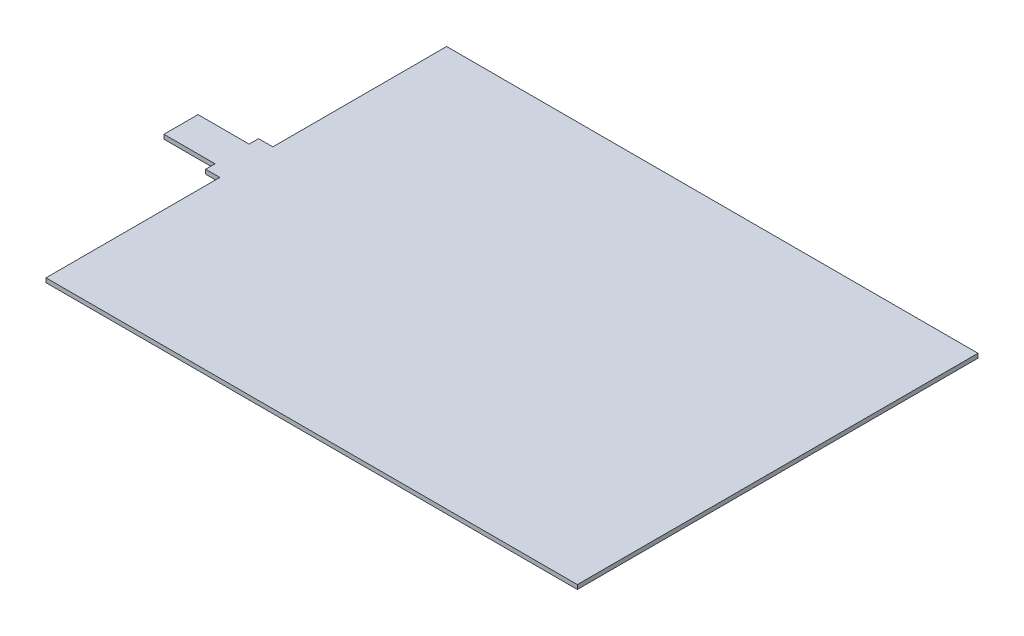
ISO-10303-21;
HEADER;
FILE_DESCRIPTION(('STEP AP214'),'2;1');
FILE_NAME('part.step','',(''),(''),'','','');
FILE_SCHEMA(('AUTOMOTIVE_DESIGN { 1 0 10303 214 1 1 1 1 }'));
ENDSEC;
DATA;
#1=APPLICATION_CONTEXT('core data for automotive mechanical design processes');
#2=APPLICATION_PROTOCOL_DEFINITION('international standard','automotive_design',2000,#1);
#3=PRODUCT_CONTEXT('',#1,'mechanical');
#4=PRODUCT('Part','Part','',(#3));
#5=PRODUCT_RELATED_PRODUCT_CATEGORY('part','',(#4));
#6=PRODUCT_DEFINITION_FORMATION('','',#4);
#7=PRODUCT_DEFINITION_CONTEXT('part definition',#1,'design');
#8=PRODUCT_DEFINITION('design','',#6,#7);
#9=PRODUCT_DEFINITION_SHAPE('','',#8);
#10=(LENGTH_UNIT() NAMED_UNIT(*) SI_UNIT(.MILLI.,.METRE.));
#11=(NAMED_UNIT(*) PLANE_ANGLE_UNIT() SI_UNIT($,.RADIAN.));
#12=(NAMED_UNIT(*) SI_UNIT($,.STERADIAN.) SOLID_ANGLE_UNIT());
#13=UNCERTAINTY_MEASURE_WITH_UNIT(LENGTH_MEASURE(1.E-05),#10,'distance_accuracy_value','');
#14=(GEOMETRIC_REPRESENTATION_CONTEXT(3) GLOBAL_UNCERTAINTY_ASSIGNED_CONTEXT((#13)) GLOBAL_UNIT_ASSIGNED_CONTEXT((#10,
#11,#12)) REPRESENTATION_CONTEXT('',''));
#15=CARTESIAN_POINT('',(0.,0.,0.));
#16=DIRECTION('',(0.,0.,1.));
#17=DIRECTION('',(1.,0.,0.));
#18=AXIS2_PLACEMENT_3D('',#15,#16,#17);
#19=CARTESIAN_POINT('',(-98.5,1.5,9.325));
#20=DIRECTION('',(1.,0.,0.));
#21=DIRECTION('',(0.,0.,-1.));
#22=AXIS2_PLACEMENT_3D('',#19,#20,#21);
#23=PLANE('',#22);
#24=DIRECTION('',(0.,1.,0.));
#25=VECTOR('',#24,1.);
#26=CARTESIAN_POINT('',(-98.5,-21.6333076527839,6.00000000000001));
#27=LINE('',#26,#25);
#28=CARTESIAN_POINT('',(-98.5,0.,6.00000000000001));
#29=VERTEX_POINT('',#28);
#30=CARTESIAN_POINT('',(-98.5,1.5,6.00000000000001));
#31=VERTEX_POINT('',#30);
#32=EDGE_CURVE('E235',#29,#31,#27,.T.);
#33=ORIENTED_EDGE('',*,*,#32,.F.);
#34=DIRECTION('',(0.,0.,1.));
#35=VECTOR('',#34,1.);
#36=CARTESIAN_POINT('',(-98.5,0.,9.325));
#37=LINE('',#36,#35);
#38=CARTESIAN_POINT('',(-98.5,0.,9.325));
#39=VERTEX_POINT('',#38);
#40=EDGE_CURVE('E173',#29,#39,#37,.T.);
#41=ORIENTED_EDGE('',*,*,#40,.T.);
#42=DIRECTION('',(0.,-1.,0.));
#43=VECTOR('',#42,1.);
#44=CARTESIAN_POINT('',(-98.5,1.5,9.325));
#45=LINE('',#44,#43);
#46=CARTESIAN_POINT('',(-98.5,1.5,9.325));
#47=VERTEX_POINT('',#46);
#48=EDGE_CURVE('E148',#47,#39,#45,.T.);
#49=ORIENTED_EDGE('',*,*,#48,.F.);
#50=DIRECTION('',(0.,0.,1.));
#51=VECTOR('',#50,1.);
#52=CARTESIAN_POINT('',(-98.5,1.5,9.325));
#53=LINE('',#52,#51);
#54=EDGE_CURVE('E133',#31,#47,#53,.T.);
#55=ORIENTED_EDGE('',*,*,#54,.F.);
#56=EDGE_LOOP('',(#33,#41,#49,#55));
#57=FACE_BOUND('',#56,.T.);
#58=ADVANCED_FACE('F43',(#57),#23,.F.);
#59=CARTESIAN_POINT('',(93.5,1.5,70.5));
#60=DIRECTION('',(-1.,0.,0.));
#61=DIRECTION('',(0.,0.,1.));
#62=AXIS2_PLACEMENT_3D('',#59,#60,#61);
#63=PLANE('',#62);
#64=DIRECTION('',(0.,0.,-1.));
#65=VECTOR('',#64,1.);
#66=CARTESIAN_POINT('',(93.5,0.,70.5));
#67=LINE('',#66,#65);
#68=CARTESIAN_POINT('',(93.5,0.,70.5));
#69=VERTEX_POINT('',#68);
#70=CARTESIAN_POINT('',(93.5,0.,-70.5));
#71=VERTEX_POINT('',#70);
#72=EDGE_CURVE('E159',#69,#71,#67,.T.);
#73=ORIENTED_EDGE('',*,*,#72,.T.);
#74=DIRECTION('',(0.,-1.,0.));
#75=VECTOR('',#74,1.);
#76=CARTESIAN_POINT('',(93.5,1.5,-70.5));
#77=LINE('',#76,#75);
#78=CARTESIAN_POINT('',(93.5,1.5,-70.5));
#79=VERTEX_POINT('',#78);
#80=EDGE_CURVE('E11',#79,#71,#77,.T.);
#81=ORIENTED_EDGE('',*,*,#80,.F.);
#82=DIRECTION('',(0.,0.,-1.));
#83=VECTOR('',#82,1.);
#84=CARTESIAN_POINT('',(93.5,1.5,70.5));
#85=LINE('',#84,#83);
#86=CARTESIAN_POINT('',(93.5,1.5,70.5));
#87=VERTEX_POINT('',#86);
#88=EDGE_CURVE('E185',#87,#79,#85,.T.);
#89=ORIENTED_EDGE('',*,*,#88,.F.);
#90=DIRECTION('',(0.,-1.,0.));
#91=VECTOR('',#90,1.);
#92=CARTESIAN_POINT('',(93.5,1.5,70.5));
#93=LINE('',#92,#91);
#94=EDGE_CURVE('E155',#87,#69,#93,.T.);
#95=ORIENTED_EDGE('',*,*,#94,.T.);
#96=EDGE_LOOP('',(#73,#81,#89,#95));
#97=FACE_BOUND('',#96,.T.);
#98=ADVANCED_FACE('F45',(#97),#63,.F.);
#99=CARTESIAN_POINT('',(-93.5,1.5,-70.5));
#100=DIRECTION('',(0.,0.,1.));
#101=DIRECTION('',(1.,0.,0.));
#102=AXIS2_PLACEMENT_3D('',#99,#100,#101);
#103=PLANE('',#102);
#104=DIRECTION('',(-1.,0.,0.));
#105=VECTOR('',#104,1.);
#106=CARTESIAN_POINT('',(-93.5,0.,-70.5));
#107=LINE('',#106,#105);
#108=CARTESIAN_POINT('',(-93.5,0.,-70.5));
#109=VERTEX_POINT('',#108);
#110=EDGE_CURVE('E163',#71,#109,#107,.T.);
#111=ORIENTED_EDGE('',*,*,#110,.T.);
#112=DIRECTION('',(0.,-1.,0.));
#113=VECTOR('',#112,1.);
#114=CARTESIAN_POINT('',(-93.5,1.5,-70.5));
#115=LINE('',#114,#113);
#116=CARTESIAN_POINT('',(-93.5,1.5,-70.5));
#117=VERTEX_POINT('',#116);
#118=EDGE_CURVE('E52',#117,#109,#115,.T.);
#119=ORIENTED_EDGE('',*,*,#118,.F.);
#120=DIRECTION('',(-1.,0.,0.));
#121=VECTOR('',#120,1.);
#122=CARTESIAN_POINT('',(-93.5,1.5,-70.5));
#123=LINE('',#122,#121);
#124=EDGE_CURVE('E109',#79,#117,#123,.T.);
#125=ORIENTED_EDGE('',*,*,#124,.F.);
#126=ORIENTED_EDGE('',*,*,#80,.T.);
#127=EDGE_LOOP('',(#111,#119,#125,#126));
#128=FACE_BOUND('',#127,.T.);
#129=ADVANCED_FACE('F281',(#128),#103,.F.);
#130=CARTESIAN_POINT('',(-93.5,1.5,-9.325));
#131=DIRECTION('',(1.,0.,0.));
#132=DIRECTION('',(0.,0.,-1.));
#133=AXIS2_PLACEMENT_3D('',#130,#131,#132);
#134=PLANE('',#133);
#135=DIRECTION('',(0.,0.,1.));
#136=VECTOR('',#135,1.);
#137=CARTESIAN_POINT('',(-93.5,0.,-9.325));
#138=LINE('',#137,#136);
#139=CARTESIAN_POINT('',(-93.5,0.,-9.325));
#140=VERTEX_POINT('',#139);
#141=EDGE_CURVE('E167',#109,#140,#138,.T.);
#142=ORIENTED_EDGE('',*,*,#141,.T.);
#143=DIRECTION('',(0.,-1.,0.));
#144=VECTOR('',#143,1.);
#145=CARTESIAN_POINT('',(-93.5,1.5,-9.325));
#146=LINE('',#145,#144);
#147=CARTESIAN_POINT('',(-93.5,1.5,-9.325));
#148=VERTEX_POINT('',#147);
#149=EDGE_CURVE('E196',#148,#140,#146,.T.);
#150=ORIENTED_EDGE('',*,*,#149,.F.);
#151=DIRECTION('',(0.,0.,1.));
#152=VECTOR('',#151,1.);
#153=CARTESIAN_POINT('',(-93.5,1.5,-9.325));
#154=LINE('',#153,#152);
#155=EDGE_CURVE('E206',#117,#148,#154,.T.);
#156=ORIENTED_EDGE('',*,*,#155,.F.);
#157=ORIENTED_EDGE('',*,*,#118,.T.);
#158=EDGE_LOOP('',(#142,#150,#156,#157));
#159=FACE_BOUND('',#158,.T.);
#160=ADVANCED_FACE('F204',(#159),#134,.F.);
#161=CARTESIAN_POINT('',(-98.5,1.5,-9.325));
#162=DIRECTION('',(0.,0.,1.));
#163=DIRECTION('',(1.,0.,0.));
#164=AXIS2_PLACEMENT_3D('',#161,#162,#163);
#165=PLANE('',#164);
#166=DIRECTION('',(-1.,0.,0.));
#167=VECTOR('',#166,1.);
#168=CARTESIAN_POINT('',(-98.5,0.,-9.325));
#169=LINE('',#168,#167);
#170=CARTESIAN_POINT('',(-98.5,0.,-9.325));
#171=VERTEX_POINT('',#170);
#172=EDGE_CURVE('E170',#140,#171,#169,.T.);
#173=ORIENTED_EDGE('',*,*,#172,.T.);
#174=DIRECTION('',(0.,-1.,0.));
#175=VECTOR('',#174,1.);
#176=CARTESIAN_POINT('',(-98.5,1.5,-9.325));
#177=LINE('',#176,#175);
#178=CARTESIAN_POINT('',(-98.5,1.5,-9.325));
#179=VERTEX_POINT('',#178);
#180=EDGE_CURVE('E192',#179,#171,#177,.T.);
#181=ORIENTED_EDGE('',*,*,#180,.F.);
#182=DIRECTION('',(-1.,0.,0.));
#183=VECTOR('',#182,1.);
#184=CARTESIAN_POINT('',(-98.5,1.5,-9.325));
#185=LINE('',#184,#183);
#186=EDGE_CURVE('E223',#148,#179,#185,.T.);
#187=ORIENTED_EDGE('',*,*,#186,.F.);
#188=ORIENTED_EDGE('',*,*,#149,.T.);
#189=EDGE_LOOP('',(#173,#181,#187,#188));
#190=FACE_BOUND('',#189,.T.);
#191=ADVANCED_FACE('F215',(#190),#165,.F.);
#192=CARTESIAN_POINT('',(-98.5,0.,-6.00000000000001));
#193=VERTEX_POINT('',#192);
#194=EDGE_CURVE('E174',#171,#193,#37,.T.);
#195=ORIENTED_EDGE('',*,*,#194,.T.);
#196=DIRECTION('',(0.,1.,0.));
#197=VECTOR('',#196,1.);
#198=CARTESIAN_POINT('',(-98.5,-21.6333076527839,-6.00000000000001));
#199=LINE('',#198,#197);
#200=CARTESIAN_POINT('',(-98.5,1.5,-6.00000000000001));
#201=VERTEX_POINT('',#200);
#202=EDGE_CURVE('E164',#193,#201,#199,.T.);
#203=ORIENTED_EDGE('',*,*,#202,.T.);
#204=EDGE_CURVE('E138',#179,#201,#53,.T.);
#205=ORIENTED_EDGE('',*,*,#204,.F.);
#206=ORIENTED_EDGE('',*,*,#180,.T.);
#207=EDGE_LOOP('',(#195,#203,#205,#206));
#208=FACE_BOUND('',#207,.T.);
#209=ADVANCED_FACE('F219',(#208),#23,.F.);
#210=CARTESIAN_POINT('',(-98.5,1.5,9.325));
#211=DIRECTION('',(0.,0.,-1.));
#212=DIRECTION('',(-1.,0.,0.));
#213=AXIS2_PLACEMENT_3D('',#210,#211,#212);
#214=PLANE('',#213);
#215=DIRECTION('',(1.,0.,0.));
#216=VECTOR('',#215,1.);
#217=CARTESIAN_POINT('',(-98.5,0.,9.325));
#218=LINE('',#217,#216);
#219=CARTESIAN_POINT('',(-93.5,0.,9.325));
#220=VERTEX_POINT('',#219);
#221=EDGE_CURVE('E144',#39,#220,#218,.T.);
#222=ORIENTED_EDGE('',*,*,#221,.T.);
#223=DIRECTION('',(0.,-1.,0.));
#224=VECTOR('',#223,1.);
#225=CARTESIAN_POINT('',(-93.5,1.5,9.325));
#226=LINE('',#225,#224);
#227=CARTESIAN_POINT('',(-93.5,1.5,9.325));
#228=VERTEX_POINT('',#227);
#229=EDGE_CURVE('E141',#228,#220,#226,.T.);
#230=ORIENTED_EDGE('',*,*,#229,.F.);
#231=DIRECTION('',(1.,0.,0.));
#232=VECTOR('',#231,1.);
#233=CARTESIAN_POINT('',(-98.5,1.5,9.325));
#234=LINE('',#233,#232);
#235=EDGE_CURVE('E125',#47,#228,#234,.T.);
#236=ORIENTED_EDGE('',*,*,#235,.F.);
#237=ORIENTED_EDGE('',*,*,#48,.T.);
#238=EDGE_LOOP('',(#222,#230,#236,#237));
#239=FACE_BOUND('',#238,.T.);
#240=ADVANCED_FACE('F142',(#239),#214,.F.);
#241=CARTESIAN_POINT('',(-93.5,1.5,70.5));
#242=DIRECTION('',(1.,0.,0.));
#243=DIRECTION('',(0.,0.,-1.));
#244=AXIS2_PLACEMENT_3D('',#241,#242,#243);
#245=PLANE('',#244);
#246=DIRECTION('',(0.,0.,1.));
#247=VECTOR('',#246,1.);
#248=CARTESIAN_POINT('',(-93.5,0.,70.5));
#249=LINE('',#248,#247);
#250=CARTESIAN_POINT('',(-93.5,0.,70.5));
#251=VERTEX_POINT('',#250);
#252=EDGE_CURVE('E180',#220,#251,#249,.T.);
#253=ORIENTED_EDGE('',*,*,#252,.T.);
#254=DIRECTION('',(0.,-1.,0.));
#255=VECTOR('',#254,1.);
#256=CARTESIAN_POINT('',(-93.5,1.5,70.5));
#257=LINE('',#256,#255);
#258=CARTESIAN_POINT('',(-93.5,1.5,70.5));
#259=VERTEX_POINT('',#258);
#260=EDGE_CURVE('E149',#259,#251,#257,.T.);
#261=ORIENTED_EDGE('',*,*,#260,.F.);
#262=DIRECTION('',(0.,0.,1.));
#263=VECTOR('',#262,1.);
#264=CARTESIAN_POINT('',(-93.5,1.5,70.5));
#265=LINE('',#264,#263);
#266=EDGE_CURVE('E129',#228,#259,#265,.T.);
#267=ORIENTED_EDGE('',*,*,#266,.F.);
#268=ORIENTED_EDGE('',*,*,#229,.T.);
#269=EDGE_LOOP('',(#253,#261,#267,#268));
#270=FACE_BOUND('',#269,.T.);
#271=ADVANCED_FACE('F151',(#270),#245,.F.);
#272=CARTESIAN_POINT('',(-93.5,1.5,70.5));
#273=DIRECTION('',(0.,0.,-1.));
#274=DIRECTION('',(-1.,0.,0.));
#275=AXIS2_PLACEMENT_3D('',#272,#273,#274);
#276=PLANE('',#275);
#277=DIRECTION('',(1.,0.,0.));
#278=VECTOR('',#277,1.);
#279=CARTESIAN_POINT('',(-93.5,0.,70.5));
#280=LINE('',#279,#278);
#281=EDGE_CURVE('E101',#251,#69,#280,.T.);
#282=ORIENTED_EDGE('',*,*,#281,.T.);
#283=ORIENTED_EDGE('',*,*,#94,.F.);
#284=DIRECTION('',(1.,0.,0.));
#285=VECTOR('',#284,1.);
#286=CARTESIAN_POINT('',(-93.5,1.5,70.5));
#287=LINE('',#286,#285);
#288=EDGE_CURVE('E68',#259,#87,#287,.T.);
#289=ORIENTED_EDGE('',*,*,#288,.F.);
#290=ORIENTED_EDGE('',*,*,#260,.T.);
#291=EDGE_LOOP('',(#282,#283,#289,#290));
#292=FACE_BOUND('',#291,.T.);
#293=ADVANCED_FACE('F277',(#292),#276,.F.);
#294=CARTESIAN_POINT('',(0.,1.5,0.));
#295=DIRECTION('',(0.,-1.,0.));
#296=DIRECTION('',(0.,0.,-1.));
#297=AXIS2_PLACEMENT_3D('',#294,#295,#296);
#298=PLANE('',#297);
#299=ORIENTED_EDGE('',*,*,#88,.T.);
#300=ORIENTED_EDGE('',*,*,#124,.T.);
#301=ORIENTED_EDGE('',*,*,#155,.T.);
#302=ORIENTED_EDGE('',*,*,#186,.T.);
#303=ORIENTED_EDGE('',*,*,#204,.T.);
#304=DIRECTION('',(-1.,0.,0.));
#305=VECTOR('',#304,1.);
#306=CARTESIAN_POINT('',(-98.5,1.5,-6.00000000000001));
#307=LINE('',#306,#305);
#308=CARTESIAN_POINT('',(-116.5,1.5,-5.99999999999999));
#309=VERTEX_POINT('',#308);
#310=EDGE_CURVE('E59',#201,#309,#307,.T.);
#311=ORIENTED_EDGE('',*,*,#310,.T.);
#312=DIRECTION('',(0.,0.,1.));
#313=VECTOR('',#312,1.);
#314=CARTESIAN_POINT('',(-116.5,1.5,-5.99999999999999));
#315=LINE('',#314,#313);
#316=CARTESIAN_POINT('',(-116.5,1.5,6.00000000000001));
#317=VERTEX_POINT('',#316);
#318=EDGE_CURVE('E261',#309,#317,#315,.T.);
#319=ORIENTED_EDGE('',*,*,#318,.T.);
#320=DIRECTION('',(1.,0.,0.));
#321=VECTOR('',#320,1.);
#322=CARTESIAN_POINT('',(-98.5,1.5,6.00000000000001));
#323=LINE('',#322,#321);
#324=EDGE_CURVE('E258',#317,#31,#323,.T.);
#325=ORIENTED_EDGE('',*,*,#324,.T.);
#326=ORIENTED_EDGE('',*,*,#54,.T.);
#327=ORIENTED_EDGE('',*,*,#235,.T.);
#328=ORIENTED_EDGE('',*,*,#266,.T.);
#329=ORIENTED_EDGE('',*,*,#288,.T.);
#330=EDGE_LOOP('',(#299,#300,#301,#302,#303,#311,#319,#325,#326,#327,#328,#329));
#331=FACE_BOUND('',#330,.T.);
#332=ADVANCED_FACE('F127',(#331),#298,.F.);
#333=CARTESIAN_POINT('',(0.,0.,0.));
#334=DIRECTION('',(0.,-1.,0.));
#335=DIRECTION('',(0.,0.,-1.));
#336=AXIS2_PLACEMENT_3D('',#333,#334,#335);
#337=PLANE('',#336);
#338=ORIENTED_EDGE('',*,*,#72,.F.);
#339=ORIENTED_EDGE('',*,*,#281,.F.);
#340=ORIENTED_EDGE('',*,*,#252,.F.);
#341=ORIENTED_EDGE('',*,*,#221,.F.);
#342=ORIENTED_EDGE('',*,*,#40,.F.);
#343=DIRECTION('',(1.,0.,0.));
#344=VECTOR('',#343,1.);
#345=CARTESIAN_POINT('',(-98.5,0.,6.00000000000001));
#346=LINE('',#345,#344);
#347=CARTESIAN_POINT('',(-116.5,0.,6.00000000000001));
#348=VERTEX_POINT('',#347);
#349=EDGE_CURVE('E245',#348,#29,#346,.T.);
#350=ORIENTED_EDGE('',*,*,#349,.F.);
#351=DIRECTION('',(0.,0.,1.));
#352=VECTOR('',#351,1.);
#353=CARTESIAN_POINT('',(-116.5,0.,-5.99999999999999));
#354=LINE('',#353,#352);
#355=CARTESIAN_POINT('',(-116.5,0.,-5.99999999999999));
#356=VERTEX_POINT('',#355);
#357=EDGE_CURVE('E239',#356,#348,#354,.T.);
#358=ORIENTED_EDGE('',*,*,#357,.F.);
#359=DIRECTION('',(-1.,0.,0.));
#360=VECTOR('',#359,1.);
#361=CARTESIAN_POINT('',(-98.5,0.,-6.00000000000001));
#362=LINE('',#361,#360);
#363=EDGE_CURVE('E240',#193,#356,#362,.T.);
#364=ORIENTED_EDGE('',*,*,#363,.F.);
#365=ORIENTED_EDGE('',*,*,#194,.F.);
#366=ORIENTED_EDGE('',*,*,#172,.F.);
#367=ORIENTED_EDGE('',*,*,#141,.F.);
#368=ORIENTED_EDGE('',*,*,#110,.F.);
#369=EDGE_LOOP('',(#338,#339,#340,#341,#342,#350,#358,#364,#365,#366,#367,#368));
#370=FACE_BOUND('',#369,.T.);
#371=ADVANCED_FACE('F210',(#370),#337,.T.);
#372=CARTESIAN_POINT('',(-98.5,-21.6333076527839,-6.00000000000001));
#373=DIRECTION('',(0.,0.,-1.));
#374=DIRECTION('',(-1.,0.,0.));
#375=AXIS2_PLACEMENT_3D('',#372,#373,#374);
#376=PLANE('',#375);
#377=ORIENTED_EDGE('',*,*,#202,.F.);
#378=ORIENTED_EDGE('',*,*,#363,.T.);
#379=DIRECTION('',(0.,1.,0.));
#380=VECTOR('',#379,1.);
#381=CARTESIAN_POINT('',(-116.5,-21.6333076527839,-5.99999999999999));
#382=LINE('',#381,#380);
#383=EDGE_CURVE('E236',#356,#309,#382,.T.);
#384=ORIENTED_EDGE('',*,*,#383,.T.);
#385=ORIENTED_EDGE('',*,*,#310,.F.);
#386=EDGE_LOOP('',(#377,#378,#384,#385));
#387=FACE_BOUND('',#386,.T.);
#388=ADVANCED_FACE('F369',(#387),#376,.T.);
#389=CARTESIAN_POINT('',(-116.5,-21.6333076527839,-5.99999999999999));
#390=DIRECTION('',(-1.,0.,0.));
#391=DIRECTION('',(0.,0.,1.));
#392=AXIS2_PLACEMENT_3D('',#389,#390,#391);
#393=PLANE('',#392);
#394=ORIENTED_EDGE('',*,*,#383,.F.);
#395=ORIENTED_EDGE('',*,*,#357,.T.);
#396=DIRECTION('',(0.,1.,0.));
#397=VECTOR('',#396,1.);
#398=CARTESIAN_POINT('',(-116.5,-21.6333076527839,6.00000000000001));
#399=LINE('',#398,#397);
#400=EDGE_CURVE('E241',#348,#317,#399,.T.);
#401=ORIENTED_EDGE('',*,*,#400,.T.);
#402=ORIENTED_EDGE('',*,*,#318,.F.);
#403=EDGE_LOOP('',(#394,#395,#401,#402));
#404=FACE_BOUND('',#403,.T.);
#405=ADVANCED_FACE('F383',(#404),#393,.T.);
#406=CARTESIAN_POINT('',(-98.5,-21.6333076527839,6.00000000000001));
#407=DIRECTION('',(0.,0.,1.));
#408=DIRECTION('',(1.,0.,0.));
#409=AXIS2_PLACEMENT_3D('',#406,#407,#408);
#410=PLANE('',#409);
#411=ORIENTED_EDGE('',*,*,#400,.F.);
#412=ORIENTED_EDGE('',*,*,#349,.T.);
#413=ORIENTED_EDGE('',*,*,#32,.T.);
#414=ORIENTED_EDGE('',*,*,#324,.F.);
#415=EDGE_LOOP('',(#411,#412,#413,#414));
#416=FACE_BOUND('',#415,.T.);
#417=ADVANCED_FACE('F392',(#416),#410,.T.);
#418=CLOSED_SHELL('',(#58,#98,#129,#160,#191,#209,#240,#271,#293,#332,#371,#388,#405,#417));
#419=MANIFOLD_SOLID_BREP('B2',#418);
#420=ADVANCED_BREP_SHAPE_REPRESENTATION('',(#18,#419),#14);
#421=SHAPE_DEFINITION_REPRESENTATION(#9,#420);
ENDSEC;
END-ISO-10303-21;
